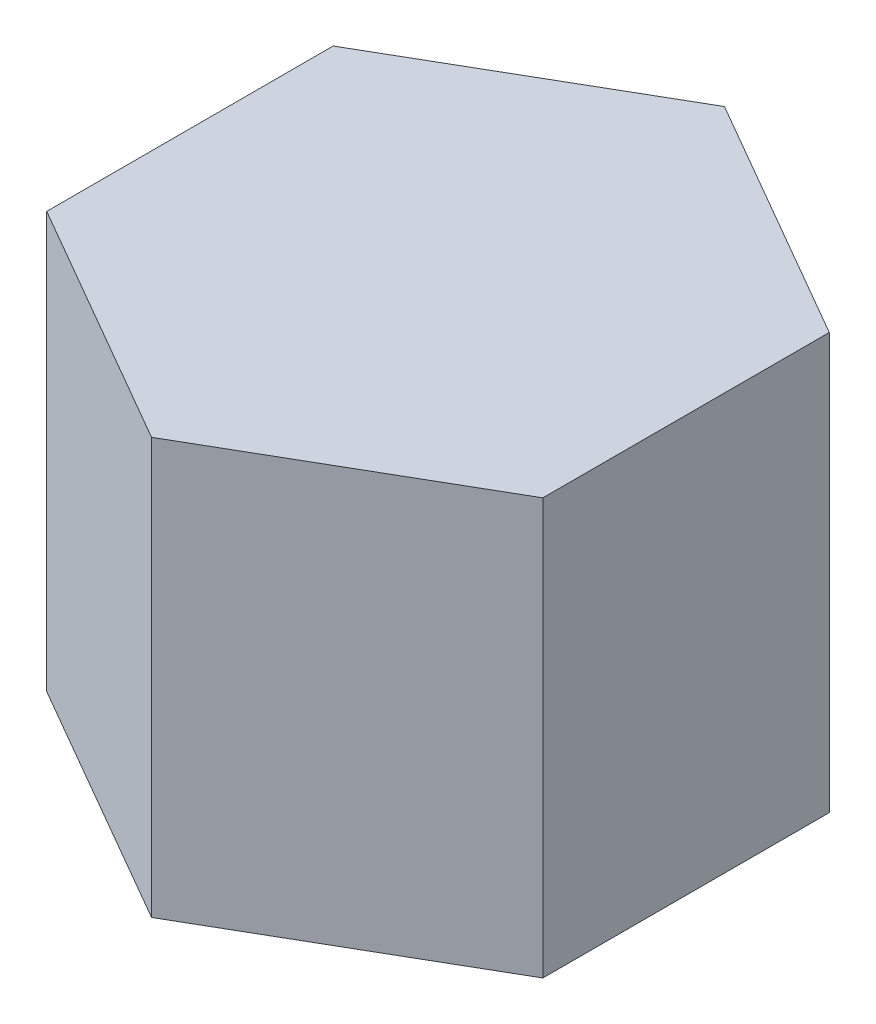
ISO-10303-21;
HEADER;
FILE_DESCRIPTION(('STEP AP214'),'2;1');
FILE_NAME('part.step','',(''),(''),'','','');
FILE_SCHEMA(('AUTOMOTIVE_DESIGN { 1 0 10303 214 1 1 1 1 }'));
ENDSEC;
DATA;
#1=APPLICATION_CONTEXT('core data for automotive mechanical design processes');
#2=APPLICATION_PROTOCOL_DEFINITION('international standard','automotive_design',2000,#1);
#3=PRODUCT_CONTEXT('',#1,'mechanical');
#4=PRODUCT('Part','Part','',(#3));
#5=PRODUCT_RELATED_PRODUCT_CATEGORY('part','',(#4));
#6=PRODUCT_DEFINITION_FORMATION('','',#4);
#7=PRODUCT_DEFINITION_CONTEXT('part definition',#1,'design');
#8=PRODUCT_DEFINITION('design','',#6,#7);
#9=PRODUCT_DEFINITION_SHAPE('','',#8);
#10=(LENGTH_UNIT() NAMED_UNIT(*) SI_UNIT(.MILLI.,.METRE.));
#11=(NAMED_UNIT(*) PLANE_ANGLE_UNIT() SI_UNIT($,.RADIAN.));
#12=(NAMED_UNIT(*) SI_UNIT($,.STERADIAN.) SOLID_ANGLE_UNIT());
#13=UNCERTAINTY_MEASURE_WITH_UNIT(LENGTH_MEASURE(1.E-05),#10,'distance_accuracy_value','');
#14=(GEOMETRIC_REPRESENTATION_CONTEXT(3) GLOBAL_UNCERTAINTY_ASSIGNED_CONTEXT((#13)) GLOBAL_UNIT_ASSIGNED_CONTEXT((#10,
#11,#12)) REPRESENTATION_CONTEXT('',''));
#15=CARTESIAN_POINT('',(0.,0.,0.));
#16=DIRECTION('',(0.,0.,1.));
#17=DIRECTION('',(1.,0.,0.));
#18=AXIS2_PLACEMENT_3D('',#15,#16,#17);
#19=CARTESIAN_POINT('',(206.142660308706,-148.537700895744,295.837098239417));
#20=DIRECTION('',(-0.499999999999943,0.,-0.866025403784472));
#21=DIRECTION('',(-0.866025403784472,0.,0.499999999999943));
#22=AXIS2_PLACEMENT_3D('',#19,#20,#21);
#23=PLANE('',#22);
#24=CARTESIAN_POINT('',(205.839551417381,-149.045793579175,296.012098239417));
#25=DIRECTION('',(0.866025403784471,0.,-0.499999999999943));
#26=VECTOR('',#25,1.);
#27=LINE('',#24,#26);
#28=CARTESIAN_POINT('',(205.839551417382,-149.045793579175,296.012098239417));
#29=VERTEX_POINT('',#28);
#30=CARTESIAN_POINT('',(206.142660308706,-149.045793579175,295.837098239417));
#31=VERTEX_POINT('',#30);
#32=EDGE_CURVE('E170',#29,#31,#27,.T.);
#33=ORIENTED_EDGE('',*,*,#32,.T.);
#34=CARTESIAN_POINT('',(206.142660308706,-148.537700895744,295.837098239417));
#35=DIRECTION('',(0.,-1.,0.));
#36=VECTOR('',#35,1.);
#37=LINE('',#34,#36);
#38=CARTESIAN_POINT('',(206.142660308706,-148.537700895744,295.837098239417));
#39=VERTEX_POINT('',#38);
#40=EDGE_CURVE('E35',#39,#31,#37,.T.);
#41=ORIENTED_EDGE('',*,*,#40,.F.);
#42=CARTESIAN_POINT('',(205.839551417381,-148.537700895744,296.012098239417));
#43=DIRECTION('',(0.866025403784471,0.,-0.499999999999943));
#44=VECTOR('',#43,1.);
#45=LINE('',#42,#44);
#46=CARTESIAN_POINT('',(205.839551417382,-148.537700895744,296.012098239417));
#47=VERTEX_POINT('',#46);
#48=EDGE_CURVE('E159',#47,#39,#45,.T.);
#49=ORIENTED_EDGE('',*,*,#48,.F.);
#50=CARTESIAN_POINT('',(205.839551417381,-148.537700895744,296.012098239417));
#51=DIRECTION('',(0.,-1.,0.));
#52=VECTOR('',#51,1.);
#53=LINE('',#50,#52);
#54=EDGE_CURVE('E10',#47,#29,#53,.T.);
#55=ORIENTED_EDGE('',*,*,#54,.T.);
#56=EDGE_LOOP('',(#33,#41,#49,#55));
#57=FACE_BOUND('',#56,.T.);
#58=ADVANCED_FACE('F16',(#57),#23,.F.);
#59=CARTESIAN_POINT('',(205.839551417382,-148.537700895744,296.012098239417));
#60=DIRECTION('',(0.500000000000062,0.,-0.866025403784403));
#61=DIRECTION('',(-0.866025403784403,0.,-0.500000000000062));
#62=AXIS2_PLACEMENT_3D('',#59,#60,#61);
#63=PLANE('',#62);
#64=CARTESIAN_POINT('',(205.536442526057,-149.045793579175,295.837098239417));
#65=DIRECTION('',(0.866025403784403,0.,0.500000000000062));
#66=VECTOR('',#65,1.);
#67=LINE('',#64,#66);
#68=CARTESIAN_POINT('',(205.536442526057,-149.045793579175,295.837098239417));
#69=VERTEX_POINT('',#68);
#70=EDGE_CURVE('E167',#69,#29,#67,.T.);
#71=ORIENTED_EDGE('',*,*,#70,.T.);
#72=ORIENTED_EDGE('',*,*,#54,.F.);
#73=CARTESIAN_POINT('',(205.536442526057,-148.537700895744,295.837098239417));
#74=DIRECTION('',(0.866025403784403,0.,0.500000000000062));
#75=VECTOR('',#74,1.);
#76=LINE('',#73,#75);
#77=CARTESIAN_POINT('',(205.536442526057,-148.537700895744,295.837098239417));
#78=VERTEX_POINT('',#77);
#79=EDGE_CURVE('E156',#78,#47,#76,.T.);
#80=ORIENTED_EDGE('',*,*,#79,.F.);
#81=CARTESIAN_POINT('',(205.536442526057,-148.537700895744,295.837098239417));
#82=DIRECTION('',(0.,-1.,0.));
#83=VECTOR('',#82,1.);
#84=LINE('',#81,#83);
#85=EDGE_CURVE('E27',#78,#69,#84,.T.);
#86=ORIENTED_EDGE('',*,*,#85,.T.);
#87=EDGE_LOOP('',(#71,#72,#80,#86));
#88=FACE_BOUND('',#87,.T.);
#89=ADVANCED_FACE('F189',(#88),#63,.F.);
#90=CARTESIAN_POINT('',(205.536442526057,-148.537700895744,290.831971220494));
#91=DIRECTION('',(1.,0.,0.));
#92=DIRECTION('',(0.,1.,0.));
#93=AXIS2_PLACEMENT_3D('',#90,#91,#92);
#94=PLANE('',#93);
#95=CARTESIAN_POINT('',(205.536442526057,-149.045793579175,295.487098239417));
#96=DIRECTION('',(0.,0.,1.));
#97=VECTOR('',#96,1.);
#98=LINE('',#95,#97);
#99=CARTESIAN_POINT('',(205.536442526057,-149.045793579175,295.487098239417));
#100=VERTEX_POINT('',#99);
#101=EDGE_CURVE('E163',#100,#69,#98,.T.);
#102=ORIENTED_EDGE('',*,*,#101,.T.);
#103=ORIENTED_EDGE('',*,*,#85,.F.);
#104=CARTESIAN_POINT('',(205.536442526057,-148.537700895744,295.487098239417));
#105=DIRECTION('',(0.,0.,1.));
#106=VECTOR('',#105,1.);
#107=LINE('',#104,#106);
#108=CARTESIAN_POINT('',(205.536442526057,-148.537700895744,295.487098239417));
#109=VERTEX_POINT('',#108);
#110=EDGE_CURVE('E106',#109,#78,#107,.T.);
#111=ORIENTED_EDGE('',*,*,#110,.F.);
#112=CARTESIAN_POINT('',(205.536442526057,-148.537700895744,295.487098239417));
#113=DIRECTION('',(0.,-1.,0.));
#114=VECTOR('',#113,1.);
#115=LINE('',#112,#114);
#116=EDGE_CURVE('E94',#109,#100,#115,.T.);
#117=ORIENTED_EDGE('',*,*,#116,.T.);
#118=EDGE_LOOP('',(#102,#103,#111,#117));
#119=FACE_BOUND('',#118,.T.);
#120=ADVANCED_FACE('F198',(#119),#94,.F.);
#121=CARTESIAN_POINT('',(205.536442526057,-148.537700895744,295.487098239417));
#122=DIRECTION('',(0.499999999999978,0.,0.866025403784452));
#123=DIRECTION('',(0.866025403784452,0.,-0.499999999999978));
#124=AXIS2_PLACEMENT_3D('',#121,#122,#123);
#125=PLANE('',#124);
#126=CARTESIAN_POINT('',(205.839551417382,-149.045793579175,295.312098239417));
#127=DIRECTION('',(-0.866025403784452,0.,0.499999999999978));
#128=VECTOR('',#127,1.);
#129=LINE('',#126,#128);
#130=CARTESIAN_POINT('',(205.839551417382,-149.045793579175,295.312098239417));
#131=VERTEX_POINT('',#130);
#132=EDGE_CURVE('E162',#131,#100,#129,.T.);
#133=ORIENTED_EDGE('',*,*,#132,.T.);
#134=ORIENTED_EDGE('',*,*,#116,.F.);
#135=CARTESIAN_POINT('',(205.839551417382,-148.537700895744,295.312098239417));
#136=DIRECTION('',(-0.866025403784452,0.,0.499999999999978));
#137=VECTOR('',#136,1.);
#138=LINE('',#135,#137);
#139=CARTESIAN_POINT('',(205.839551417382,-148.537700895744,295.312098239417));
#140=VERTEX_POINT('',#139);
#141=EDGE_CURVE('E98',#140,#109,#138,.T.);
#142=ORIENTED_EDGE('',*,*,#141,.F.);
#143=CARTESIAN_POINT('',(205.839551417382,-148.537700895744,295.312098239417));
#144=DIRECTION('',(0.,-1.,0.));
#145=VECTOR('',#144,1.);
#146=LINE('',#143,#145);
#147=EDGE_CURVE('E79',#140,#131,#146,.T.);
#148=ORIENTED_EDGE('',*,*,#147,.T.);
#149=EDGE_LOOP('',(#133,#134,#142,#148));
#150=FACE_BOUND('',#149,.T.);
#151=ADVANCED_FACE('F100',(#150),#125,.F.);
#152=CARTESIAN_POINT('',(205.839551417382,-148.537700895744,295.312098239417));
#153=DIRECTION('',(-0.500000000000012,0.,0.866025403784432));
#154=DIRECTION('',(0.866025403784432,0.,0.500000000000012));
#155=AXIS2_PLACEMENT_3D('',#152,#153,#154);
#156=PLANE('',#155);
#157=CARTESIAN_POINT('',(206.142660308706,-149.045793579175,295.487098239417));
#158=DIRECTION('',(-0.866025403784432,0.,-0.500000000000012));
#159=VECTOR('',#158,1.);
#160=LINE('',#157,#159);
#161=CARTESIAN_POINT('',(206.142660308706,-149.045793579175,295.487098239417));
#162=VERTEX_POINT('',#161);
#163=EDGE_CURVE('E88',#162,#131,#160,.T.);
#164=ORIENTED_EDGE('',*,*,#163,.T.);
#165=ORIENTED_EDGE('',*,*,#147,.F.);
#166=CARTESIAN_POINT('',(206.142660308706,-148.537700895744,295.487098239417));
#167=DIRECTION('',(-0.866025403784432,0.,-0.500000000000012));
#168=VECTOR('',#167,1.);
#169=LINE('',#166,#168);
#170=CARTESIAN_POINT('',(206.142660308706,-148.537700895744,295.487098239417));
#171=VERTEX_POINT('',#170);
#172=EDGE_CURVE('E84',#171,#140,#169,.T.);
#173=ORIENTED_EDGE('',*,*,#172,.F.);
#174=CARTESIAN_POINT('',(206.142660308706,-148.537700895744,295.487098239417));
#175=DIRECTION('',(0.,-1.,0.));
#176=VECTOR('',#175,1.);
#177=LINE('',#174,#176);
#178=EDGE_CURVE('E58',#171,#162,#177,.T.);
#179=ORIENTED_EDGE('',*,*,#178,.T.);
#180=EDGE_LOOP('',(#164,#165,#173,#179));
#181=FACE_BOUND('',#180,.T.);
#182=ADVANCED_FACE('F82',(#181),#156,.F.);
#183=CARTESIAN_POINT('',(206.142660308706,-148.537700895744,290.831971220494));
#184=DIRECTION('',(-1.,0.,0.));
#185=DIRECTION('',(0.,-1.,0.));
#186=AXIS2_PLACEMENT_3D('',#183,#184,#185);
#187=PLANE('',#186);
#188=CARTESIAN_POINT('',(206.142660308706,-149.045793579175,295.837098239417));
#189=DIRECTION('',(0.,0.,-1.));
#190=VECTOR('',#189,1.);
#191=LINE('',#188,#190);
#192=EDGE_CURVE('E160',#31,#162,#191,.T.);
#193=ORIENTED_EDGE('',*,*,#192,.T.);
#194=ORIENTED_EDGE('',*,*,#178,.F.);
#195=CARTESIAN_POINT('',(206.142660308706,-148.537700895744,295.837098239417));
#196=DIRECTION('',(0.,0.,-1.));
#197=VECTOR('',#196,1.);
#198=LINE('',#195,#197);
#199=EDGE_CURVE('E112',#39,#171,#198,.T.);
#200=ORIENTED_EDGE('',*,*,#199,.F.);
#201=ORIENTED_EDGE('',*,*,#40,.T.);
#202=EDGE_LOOP('',(#193,#194,#200,#201));
#203=FACE_BOUND('',#202,.T.);
#204=ADVANCED_FACE('F131',(#203),#187,.F.);
#205=CARTESIAN_POINT('',(206.339551417382,-148.537700895744,290.831971220494));
#206=DIRECTION('',(0.,-1.,0.));
#207=DIRECTION('',(1.,0.,0.));
#208=AXIS2_PLACEMENT_3D('',#205,#206,#207);
#209=PLANE('',#208);
#210=ORIENTED_EDGE('',*,*,#48,.T.);
#211=ORIENTED_EDGE('',*,*,#199,.T.);
#212=ORIENTED_EDGE('',*,*,#172,.T.);
#213=ORIENTED_EDGE('',*,*,#141,.T.);
#214=ORIENTED_EDGE('',*,*,#110,.T.);
#215=ORIENTED_EDGE('',*,*,#79,.T.);
#216=EDGE_LOOP('',(#210,#211,#212,#213,#214,#215));
#217=FACE_BOUND('',#216,.T.);
#218=ADVANCED_FACE('F111',(#217),#209,.F.);
#219=CARTESIAN_POINT('',(206.339551417382,-149.045793579175,290.831971220494));
#220=DIRECTION('',(0.,-1.,0.));
#221=DIRECTION('',(1.,0.,0.));
#222=AXIS2_PLACEMENT_3D('',#219,#220,#221);
#223=PLANE('',#222);
#224=ORIENTED_EDGE('',*,*,#32,.F.);
#225=ORIENTED_EDGE('',*,*,#70,.F.);
#226=ORIENTED_EDGE('',*,*,#101,.F.);
#227=ORIENTED_EDGE('',*,*,#132,.F.);
#228=ORIENTED_EDGE('',*,*,#163,.F.);
#229=ORIENTED_EDGE('',*,*,#192,.F.);
#230=EDGE_LOOP('',(#224,#225,#226,#227,#228,#229));
#231=FACE_BOUND('',#230,.T.);
#232=ADVANCED_FACE('F130',(#231),#223,.T.);
#233=CLOSED_SHELL('',(#58,#89,#120,#151,#182,#204,#218,#232));
#234=MANIFOLD_SOLID_BREP('B1',#233);
#235=ADVANCED_BREP_SHAPE_REPRESENTATION('',(#18,#234),#14);
#236=SHAPE_DEFINITION_REPRESENTATION(#9,#235);
ENDSEC;
END-ISO-10303-21;
